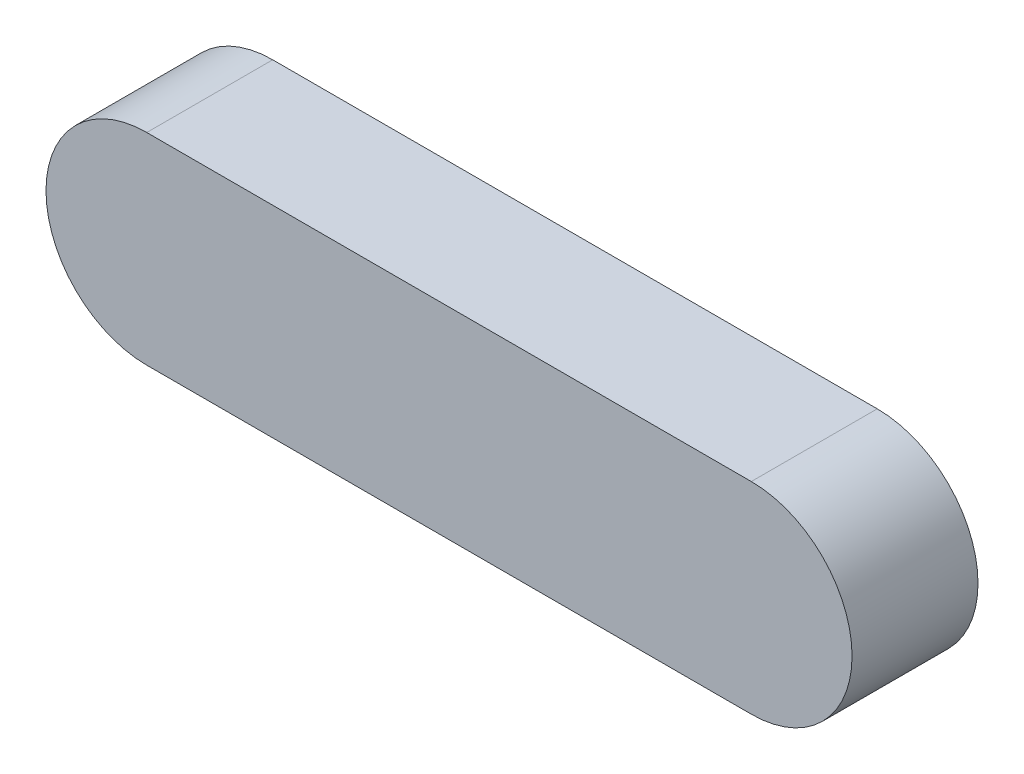
ISO-10303-21;
HEADER;
FILE_DESCRIPTION(('STEP AP214'),'2;1');
FILE_NAME('part.step','',(''),(''),'','','');
FILE_SCHEMA(('AUTOMOTIVE_DESIGN { 1 0 10303 214 1 1 1 1 }'));
ENDSEC;
DATA;
#1=APPLICATION_CONTEXT('core data for automotive mechanical design processes');
#2=APPLICATION_PROTOCOL_DEFINITION('international standard','automotive_design',2000,#1);
#3=PRODUCT_CONTEXT('',#1,'mechanical');
#4=PRODUCT('Part','Part','',(#3));
#5=PRODUCT_RELATED_PRODUCT_CATEGORY('part','',(#4));
#6=PRODUCT_DEFINITION_FORMATION('','',#4);
#7=PRODUCT_DEFINITION_CONTEXT('part definition',#1,'design');
#8=PRODUCT_DEFINITION('design','',#6,#7);
#9=PRODUCT_DEFINITION_SHAPE('','',#8);
#10=(LENGTH_UNIT() NAMED_UNIT(*) SI_UNIT(.MILLI.,.METRE.));
#11=(NAMED_UNIT(*) PLANE_ANGLE_UNIT() SI_UNIT($,.RADIAN.));
#12=(NAMED_UNIT(*) SI_UNIT($,.STERADIAN.) SOLID_ANGLE_UNIT());
#13=UNCERTAINTY_MEASURE_WITH_UNIT(LENGTH_MEASURE(1.E-05),#10,'distance_accuracy_value','');
#14=(GEOMETRIC_REPRESENTATION_CONTEXT(3) GLOBAL_UNCERTAINTY_ASSIGNED_CONTEXT((#13)) GLOBAL_UNIT_ASSIGNED_CONTEXT((#10,
#11,#12)) REPRESENTATION_CONTEXT('',''));
#15=CARTESIAN_POINT('',(0.,0.,0.));
#16=DIRECTION('',(0.,0.,1.));
#17=DIRECTION('',(1.,0.,0.));
#18=AXIS2_PLACEMENT_3D('',#15,#16,#17);
#19=CARTESIAN_POINT('',(-7.66792452830189,0.,10.));
#20=DIRECTION('',(0.,0.,-1.));
#21=DIRECTION('',(-1.,0.,0.));
#22=AXIS2_PLACEMENT_3D('',#19,#20,#21);
#23=CYLINDRICAL_SURFACE('',#22,8.);
#24=CARTESIAN_POINT('',(-7.66792452830189,0.,0.));
#25=DIRECTION('',(0.,0.,1.));
#26=DIRECTION('',(1.,0.,0.));
#27=AXIS2_PLACEMENT_3D('',#24,#25,#26);
#28=CIRCLE('',#27,8.);
#29=CARTESIAN_POINT('',(-7.66792452830189,8.,0.));
#30=VERTEX_POINT('',#29);
#31=CARTESIAN_POINT('',(-7.66792452830189,-8.,0.));
#32=VERTEX_POINT('',#31);
#33=EDGE_CURVE('E107',#30,#32,#28,.T.);
#34=ORIENTED_EDGE('',*,*,#33,.T.);
#35=DIRECTION('',(0.,0.,-1.));
#36=VECTOR('',#35,1.);
#37=CARTESIAN_POINT('',(-7.66792452830189,-8.,10.));
#38=LINE('',#37,#36);
#39=CARTESIAN_POINT('',(-7.66792452830189,-8.,10.));
#40=VERTEX_POINT('',#39);
#41=EDGE_CURVE('E11',#40,#32,#38,.T.);
#42=ORIENTED_EDGE('',*,*,#41,.F.);
#43=CARTESIAN_POINT('',(-7.66792452830189,0.,10.));
#44=DIRECTION('',(0.,0.,1.));
#45=DIRECTION('',(1.,0.,0.));
#46=AXIS2_PLACEMENT_3D('',#43,#44,#45);
#47=CIRCLE('',#46,8.);
#48=CARTESIAN_POINT('',(-7.66792452830189,8.,10.));
#49=VERTEX_POINT('',#48);
#50=EDGE_CURVE('E91',#49,#40,#47,.T.);
#51=ORIENTED_EDGE('',*,*,#50,.F.);
#52=DIRECTION('',(0.,0.,-1.));
#53=VECTOR('',#52,1.);
#54=CARTESIAN_POINT('',(-7.66792452830189,8.,10.));
#55=LINE('',#54,#53);
#56=EDGE_CURVE('E103',#49,#30,#55,.T.);
#57=ORIENTED_EDGE('',*,*,#56,.T.);
#58=EDGE_LOOP('',(#34,#42,#51,#57));
#59=FACE_BOUND('',#58,.T.);
#60=ADVANCED_FACE('F39',(#59),#23,.T.);
#61=CARTESIAN_POINT('',(-7.66792452830189,-8.,10.));
#62=DIRECTION('',(0.,1.,0.));
#63=DIRECTION('',(0.,0.,1.));
#64=AXIS2_PLACEMENT_3D('',#61,#62,#63);
#65=PLANE('',#64);
#66=DIRECTION('',(1.,0.,0.));
#67=VECTOR('',#66,1.);
#68=CARTESIAN_POINT('',(-7.66792452830189,-8.,0.));
#69=LINE('',#68,#67);
#70=CARTESIAN_POINT('',(40.3320754716981,-8.,0.));
#71=VERTEX_POINT('',#70);
#72=EDGE_CURVE('E96',#32,#71,#69,.T.);
#73=ORIENTED_EDGE('',*,*,#72,.T.);
#74=DIRECTION('',(0.,0.,-1.));
#75=VECTOR('',#74,1.);
#76=CARTESIAN_POINT('',(40.3320754716981,-8.,10.));
#77=LINE('',#76,#75);
#78=CARTESIAN_POINT('',(40.3320754716981,-8.,10.));
#79=VERTEX_POINT('',#78);
#80=EDGE_CURVE('E48',#79,#71,#77,.T.);
#81=ORIENTED_EDGE('',*,*,#80,.F.);
#82=DIRECTION('',(1.,0.,0.));
#83=VECTOR('',#82,1.);
#84=CARTESIAN_POINT('',(-7.66792452830189,-8.,10.));
#85=LINE('',#84,#83);
#86=EDGE_CURVE('E86',#40,#79,#85,.T.);
#87=ORIENTED_EDGE('',*,*,#86,.F.);
#88=ORIENTED_EDGE('',*,*,#41,.T.);
#89=EDGE_LOOP('',(#73,#81,#87,#88));
#90=FACE_BOUND('',#89,.T.);
#91=ADVANCED_FACE('F95',(#90),#65,.F.);
#92=CARTESIAN_POINT('',(40.3320754716981,0.,10.));
#93=DIRECTION('',(0.,0.,-1.));
#94=DIRECTION('',(-1.,0.,0.));
#95=AXIS2_PLACEMENT_3D('',#92,#93,#94);
#96=CYLINDRICAL_SURFACE('',#95,8.);
#97=CARTESIAN_POINT('',(40.3320754716981,0.,0.));
#98=DIRECTION('',(0.,0.,1.));
#99=DIRECTION('',(1.,0.,0.));
#100=AXIS2_PLACEMENT_3D('',#97,#98,#99);
#101=CIRCLE('',#100,8.);
#102=CARTESIAN_POINT('',(40.3320754716981,8.,0.));
#103=VERTEX_POINT('',#102);
#104=EDGE_CURVE('E73',#71,#103,#101,.T.);
#105=ORIENTED_EDGE('',*,*,#104,.T.);
#106=DIRECTION('',(0.,0.,-1.));
#107=VECTOR('',#106,1.);
#108=CARTESIAN_POINT('',(40.3320754716981,8.,10.));
#109=LINE('',#108,#107);
#110=CARTESIAN_POINT('',(40.3320754716981,8.,10.));
#111=VERTEX_POINT('',#110);
#112=EDGE_CURVE('E98',#111,#103,#109,.T.);
#113=ORIENTED_EDGE('',*,*,#112,.F.);
#114=CARTESIAN_POINT('',(40.3320754716981,0.,10.));
#115=DIRECTION('',(0.,0.,1.));
#116=DIRECTION('',(1.,0.,0.));
#117=AXIS2_PLACEMENT_3D('',#114,#115,#116);
#118=CIRCLE('',#117,8.);
#119=EDGE_CURVE('E89',#79,#111,#118,.T.);
#120=ORIENTED_EDGE('',*,*,#119,.F.);
#121=ORIENTED_EDGE('',*,*,#80,.T.);
#122=EDGE_LOOP('',(#105,#113,#120,#121));
#123=FACE_BOUND('',#122,.T.);
#124=ADVANCED_FACE('F99',(#123),#96,.T.);
#125=CARTESIAN_POINT('',(-7.66792452830189,8.,10.));
#126=DIRECTION('',(0.,-1.,0.));
#127=DIRECTION('',(0.,0.,-1.));
#128=AXIS2_PLACEMENT_3D('',#125,#126,#127);
#129=PLANE('',#128);
#130=DIRECTION('',(-1.,0.,0.));
#131=VECTOR('',#130,1.);
#132=CARTESIAN_POINT('',(-7.66792452830189,8.,0.));
#133=LINE('',#132,#131);
#134=EDGE_CURVE('E79',#103,#30,#133,.T.);
#135=ORIENTED_EDGE('',*,*,#134,.T.);
#136=ORIENTED_EDGE('',*,*,#56,.F.);
#137=DIRECTION('',(-1.,0.,0.));
#138=VECTOR('',#137,1.);
#139=CARTESIAN_POINT('',(-7.66792452830189,8.,10.));
#140=LINE('',#139,#138);
#141=EDGE_CURVE('E56',#111,#49,#140,.T.);
#142=ORIENTED_EDGE('',*,*,#141,.F.);
#143=ORIENTED_EDGE('',*,*,#112,.T.);
#144=EDGE_LOOP('',(#135,#136,#142,#143));
#145=FACE_BOUND('',#144,.T.);
#146=ADVANCED_FACE('F120',(#145),#129,.F.);
#147=CARTESIAN_POINT('',(-7.66792452830189,0.,10.));
#148=DIRECTION('',(0.,0.,1.));
#149=DIRECTION('',(1.,0.,0.));
#150=AXIS2_PLACEMENT_3D('',#147,#148,#149);
#151=PLANE('',#150);
#152=ORIENTED_EDGE('',*,*,#50,.T.);
#153=ORIENTED_EDGE('',*,*,#86,.T.);
#154=ORIENTED_EDGE('',*,*,#119,.T.);
#155=ORIENTED_EDGE('',*,*,#141,.T.);
#156=EDGE_LOOP('',(#152,#153,#154,#155));
#157=FACE_BOUND('',#156,.T.);
#158=ADVANCED_FACE('F87',(#157),#151,.T.);
#159=CARTESIAN_POINT('',(-7.66792452830189,0.,0.));
#160=DIRECTION('',(0.,0.,1.));
#161=DIRECTION('',(1.,0.,0.));
#162=AXIS2_PLACEMENT_3D('',#159,#160,#161);
#163=PLANE('',#162);
#164=ORIENTED_EDGE('',*,*,#33,.F.);
#165=ORIENTED_EDGE('',*,*,#134,.F.);
#166=ORIENTED_EDGE('',*,*,#104,.F.);
#167=ORIENTED_EDGE('',*,*,#72,.F.);
#168=EDGE_LOOP('',(#164,#165,#166,#167));
#169=FACE_BOUND('',#168,.T.);
#170=ADVANCED_FACE('F123',(#169),#163,.F.);
#171=CLOSED_SHELL('',(#60,#91,#124,#146,#158,#170));
#172=MANIFOLD_SOLID_BREP('B2',#171);
#173=ADVANCED_BREP_SHAPE_REPRESENTATION('',(#18,#172),#14);
#174=SHAPE_DEFINITION_REPRESENTATION(#9,#173);
ENDSEC;
END-ISO-10303-21;
